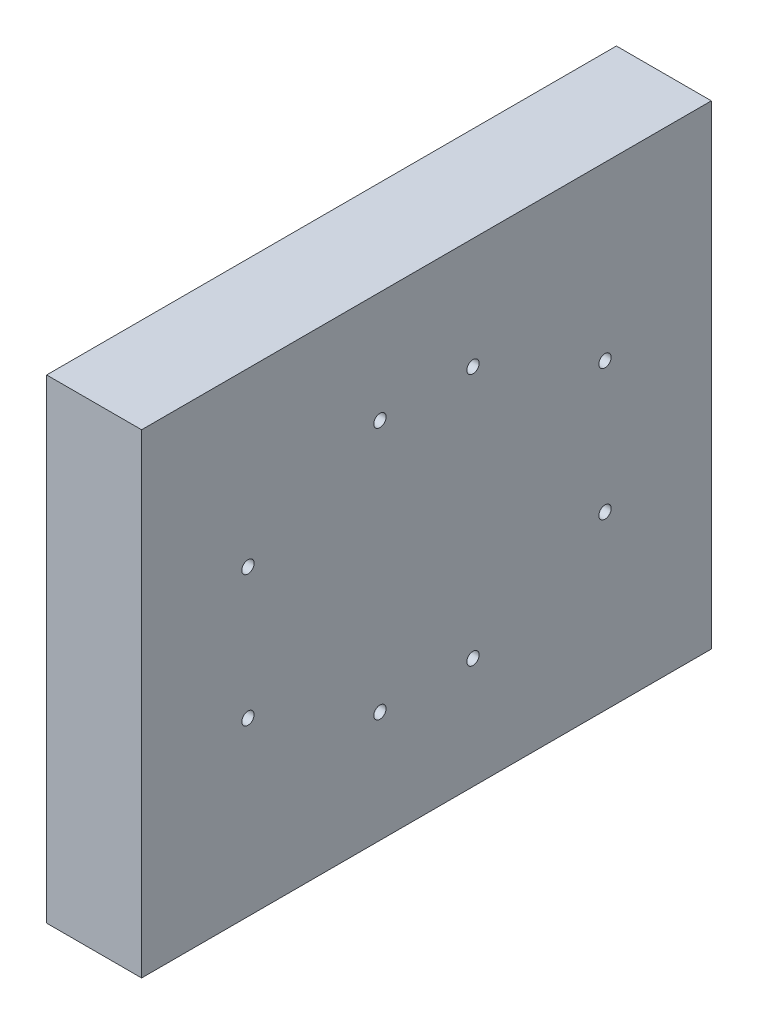
ISO-10303-21;
HEADER;
FILE_DESCRIPTION(('STEP AP214'),'2;1');
FILE_NAME('part.step','',(''),(''),'','','');
FILE_SCHEMA(('AUTOMOTIVE_DESIGN { 1 0 10303 214 1 1 1 1 }'));
ENDSEC;
DATA;
#1=APPLICATION_CONTEXT('core data for automotive mechanical design processes');
#2=APPLICATION_PROTOCOL_DEFINITION('international standard','automotive_design',2000,#1);
#3=PRODUCT_CONTEXT('',#1,'mechanical');
#4=PRODUCT('Part','Part','',(#3));
#5=PRODUCT_RELATED_PRODUCT_CATEGORY('part','',(#4));
#6=PRODUCT_DEFINITION_FORMATION('','',#4);
#7=PRODUCT_DEFINITION_CONTEXT('part definition',#1,'design');
#8=PRODUCT_DEFINITION('design','',#6,#7);
#9=PRODUCT_DEFINITION_SHAPE('','',#8);
#10=(LENGTH_UNIT() NAMED_UNIT(*) SI_UNIT(.MILLI.,.METRE.));
#11=(NAMED_UNIT(*) PLANE_ANGLE_UNIT() SI_UNIT($,.RADIAN.));
#12=(NAMED_UNIT(*) SI_UNIT($,.STERADIAN.) SOLID_ANGLE_UNIT());
#13=UNCERTAINTY_MEASURE_WITH_UNIT(LENGTH_MEASURE(1.E-05),#10,'distance_accuracy_value','');
#14=(GEOMETRIC_REPRESENTATION_CONTEXT(3) GLOBAL_UNCERTAINTY_ASSIGNED_CONTEXT((#13)) GLOBAL_UNIT_ASSIGNED_CONTEXT((#10,
#11,#12)) REPRESENTATION_CONTEXT('',''));
#15=CARTESIAN_POINT('',(0.,0.,0.));
#16=DIRECTION('',(0.,0.,1.));
#17=DIRECTION('',(1.,0.,0.));
#18=AXIS2_PLACEMENT_3D('',#15,#16,#17);
#19=CARTESIAN_POINT('',(25.4,0.,0.));
#20=DIRECTION('',(-1.,0.,0.));
#21=DIRECTION('',(0.,0.,1.));
#22=AXIS2_PLACEMENT_3D('',#19,#20,#21);
#23=PLANE('',#22);
#24=DIRECTION('',(0.,-1.,0.));
#25=VECTOR('',#24,1.);
#26=CARTESIAN_POINT('',(25.4,0.,0.));
#27=LINE('',#26,#25);
#28=CARTESIAN_POINT('',(25.4,127.,0.));
#29=VERTEX_POINT('',#28);
#30=CARTESIAN_POINT('',(25.4,0.,0.));
#31=VERTEX_POINT('',#30);
#32=EDGE_CURVE('E85',#29,#31,#27,.T.);
#33=ORIENTED_EDGE('',*,*,#32,.T.);
#34=DIRECTION('',(0.,0.,-1.));
#35=VECTOR('',#34,1.);
#36=CARTESIAN_POINT('',(25.4,0.,0.));
#37=LINE('',#36,#35);
#38=CARTESIAN_POINT('',(25.4,0.,-152.4));
#39=VERTEX_POINT('',#38);
#40=EDGE_CURVE('E80',#31,#39,#37,.T.);
#41=ORIENTED_EDGE('',*,*,#40,.T.);
#42=DIRECTION('',(0.,1.,0.));
#43=VECTOR('',#42,1.);
#44=CARTESIAN_POINT('',(25.4,0.,-152.4));
#45=LINE('',#44,#43);
#46=CARTESIAN_POINT('',(25.4,127.,-152.4));
#47=VERTEX_POINT('',#46);
#48=EDGE_CURVE('E83',#39,#47,#45,.T.);
#49=ORIENTED_EDGE('',*,*,#48,.T.);
#50=DIRECTION('',(0.,0.,1.));
#51=VECTOR('',#50,1.);
#52=CARTESIAN_POINT('',(25.4,127.,0.));
#53=LINE('',#52,#51);
#54=EDGE_CURVE('E50',#47,#29,#53,.T.);
#55=ORIENTED_EDGE('',*,*,#54,.T.);
#56=EDGE_LOOP('',(#33,#41,#49,#55));
#57=FACE_BOUND('',#56,.T.);
#58=CARTESIAN_POINT('',(25.4,81.026,-28.448));
#59=DIRECTION('',(1.,0.,0.));
#60=DIRECTION('',(0.,0.,-1.));
#61=AXIS2_PLACEMENT_3D('',#58,#59,#60);
#62=CIRCLE('',#61,1.651);
#63=CARTESIAN_POINT('',(25.4,81.026,-30.099));
#64=VERTEX_POINT('',#63);
#65=EDGE_CURVE('E100',#64,#64,#62,.T.);
#66=ORIENTED_EDGE('',*,*,#65,.F.);
#67=EDGE_LOOP('',(#66));
#68=FACE_BOUND('',#67,.T.);
#69=CARTESIAN_POINT('',(25.4,45.974,-28.448));
#70=DIRECTION('',(1.,0.,0.));
#71=DIRECTION('',(0.,0.,-1.));
#72=AXIS2_PLACEMENT_3D('',#69,#70,#71);
#73=CIRCLE('',#72,1.651);
#74=CARTESIAN_POINT('',(25.4,45.974,-30.099));
#75=VERTEX_POINT('',#74);
#76=EDGE_CURVE('E115',#75,#75,#73,.T.);
#77=ORIENTED_EDGE('',*,*,#76,.F.);
#78=EDGE_LOOP('',(#77));
#79=FACE_BOUND('',#78,.T.);
#80=CARTESIAN_POINT('',(25.4,81.026,-123.952));
#81=DIRECTION('',(1.,0.,0.));
#82=DIRECTION('',(0.,0.,-1.));
#83=AXIS2_PLACEMENT_3D('',#80,#81,#82);
#84=CIRCLE('',#83,1.65100000000002);
#85=CARTESIAN_POINT('',(25.4,81.026,-125.603));
#86=VERTEX_POINT('',#85);
#87=EDGE_CURVE('E121',#86,#86,#84,.T.);
#88=ORIENTED_EDGE('',*,*,#87,.F.);
#89=EDGE_LOOP('',(#88));
#90=FACE_BOUND('',#89,.T.);
#91=CARTESIAN_POINT('',(25.4,45.974,-123.952));
#92=DIRECTION('',(1.,0.,0.));
#93=DIRECTION('',(0.,0.,-1.));
#94=AXIS2_PLACEMENT_3D('',#91,#92,#93);
#95=CIRCLE('',#94,1.65100000000002);
#96=CARTESIAN_POINT('',(25.4,45.974,-125.603));
#97=VERTEX_POINT('',#96);
#98=EDGE_CURVE('E127',#97,#97,#95,.T.);
#99=ORIENTED_EDGE('',*,*,#98,.F.);
#100=EDGE_LOOP('',(#99));
#101=FACE_BOUND('',#100,.T.);
#102=CARTESIAN_POINT('',(25.4,97.282,-63.754));
#103=DIRECTION('',(1.,0.,0.));
#104=DIRECTION('',(0.,0.,-1.));
#105=AXIS2_PLACEMENT_3D('',#102,#103,#104);
#106=CIRCLE('',#105,1.65100000000001);
#107=CARTESIAN_POINT('',(25.4,97.282,-65.405));
#108=VERTEX_POINT('',#107);
#109=EDGE_CURVE('E133',#108,#108,#106,.T.);
#110=ORIENTED_EDGE('',*,*,#109,.F.);
#111=EDGE_LOOP('',(#110));
#112=FACE_BOUND('',#111,.T.);
#113=CARTESIAN_POINT('',(25.4,97.282,-88.646));
#114=DIRECTION('',(1.,0.,0.));
#115=DIRECTION('',(0.,0.,-1.));
#116=AXIS2_PLACEMENT_3D('',#113,#114,#115);
#117=CIRCLE('',#116,1.65100000000001);
#118=CARTESIAN_POINT('',(25.4,97.282,-90.297));
#119=VERTEX_POINT('',#118);
#120=EDGE_CURVE('E139',#119,#119,#117,.T.);
#121=ORIENTED_EDGE('',*,*,#120,.F.);
#122=EDGE_LOOP('',(#121));
#123=FACE_BOUND('',#122,.T.);
#124=CARTESIAN_POINT('',(25.4,29.718,-63.754));
#125=DIRECTION('',(1.,0.,0.));
#126=DIRECTION('',(0.,0.,-1.));
#127=AXIS2_PLACEMENT_3D('',#124,#125,#126);
#128=CIRCLE('',#127,1.65100000000001);
#129=CARTESIAN_POINT('',(25.4,29.718,-65.405));
#130=VERTEX_POINT('',#129);
#131=EDGE_CURVE('E145',#130,#130,#128,.T.);
#132=ORIENTED_EDGE('',*,*,#131,.F.);
#133=EDGE_LOOP('',(#132));
#134=FACE_BOUND('',#133,.T.);
#135=CARTESIAN_POINT('',(25.4,29.718,-88.646));
#136=DIRECTION('',(1.,0.,0.));
#137=DIRECTION('',(0.,0.,-1.));
#138=AXIS2_PLACEMENT_3D('',#135,#136,#137);
#139=CIRCLE('',#138,1.65100000000001);
#140=CARTESIAN_POINT('',(25.4,29.718,-90.297));
#141=VERTEX_POINT('',#140);
#142=EDGE_CURVE('E151',#141,#141,#139,.T.);
#143=ORIENTED_EDGE('',*,*,#142,.F.);
#144=EDGE_LOOP('',(#143));
#145=FACE_BOUND('',#144,.T.);
#146=ADVANCED_FACE('F33',(#57,#68,#79,#90,#101,#112,#123,#134,#145),#23,.F.);
#147=CARTESIAN_POINT('',(0.,0.,0.));
#148=DIRECTION('',(-1.,0.,0.));
#149=DIRECTION('',(0.,0.,1.));
#150=AXIS2_PLACEMENT_3D('',#147,#148,#149);
#151=PLANE('',#150);
#152=CARTESIAN_POINT('',(0.,29.718,-63.754));
#153=DIRECTION('',(1.,0.,0.));
#154=DIRECTION('',(0.,0.,-1.));
#155=AXIS2_PLACEMENT_3D('',#152,#153,#154);
#156=CIRCLE('',#155,1.65100000000001);
#157=CARTESIAN_POINT('',(0.,29.718,-65.405));
#158=VERTEX_POINT('',#157);
#159=EDGE_CURVE('E148',#158,#158,#156,.T.);
#160=ORIENTED_EDGE('',*,*,#159,.T.);
#161=EDGE_LOOP('',(#160));
#162=FACE_BOUND('',#161,.T.);
#163=CARTESIAN_POINT('',(0.,97.282,-63.754));
#164=DIRECTION('',(1.,0.,0.));
#165=DIRECTION('',(0.,0.,-1.));
#166=AXIS2_PLACEMENT_3D('',#163,#164,#165);
#167=CIRCLE('',#166,1.65100000000001);
#168=CARTESIAN_POINT('',(0.,97.282,-65.405));
#169=VERTEX_POINT('',#168);
#170=EDGE_CURVE('E136',#169,#169,#167,.T.);
#171=ORIENTED_EDGE('',*,*,#170,.T.);
#172=EDGE_LOOP('',(#171));
#173=FACE_BOUND('',#172,.T.);
#174=CARTESIAN_POINT('',(0.,81.026,-123.952));
#175=DIRECTION('',(1.,0.,0.));
#176=DIRECTION('',(0.,0.,-1.));
#177=AXIS2_PLACEMENT_3D('',#174,#175,#176);
#178=CIRCLE('',#177,1.65100000000002);
#179=CARTESIAN_POINT('',(0.,81.026,-125.603));
#180=VERTEX_POINT('',#179);
#181=EDGE_CURVE('E124',#180,#180,#178,.T.);
#182=ORIENTED_EDGE('',*,*,#181,.T.);
#183=EDGE_LOOP('',(#182));
#184=FACE_BOUND('',#183,.T.);
#185=CARTESIAN_POINT('',(0.,81.026,-28.448));
#186=DIRECTION('',(1.,0.,0.));
#187=DIRECTION('',(0.,0.,-1.));
#188=AXIS2_PLACEMENT_3D('',#185,#186,#187);
#189=CIRCLE('',#188,1.651);
#190=CARTESIAN_POINT('',(0.,81.026,-30.099));
#191=VERTEX_POINT('',#190);
#192=EDGE_CURVE('E112',#191,#191,#189,.T.);
#193=ORIENTED_EDGE('',*,*,#192,.T.);
#194=EDGE_LOOP('',(#193));
#195=FACE_BOUND('',#194,.T.);
#196=DIRECTION('',(0.,-1.,0.));
#197=VECTOR('',#196,1.);
#198=CARTESIAN_POINT('',(0.,0.,0.));
#199=LINE('',#198,#197);
#200=CARTESIAN_POINT('',(0.,127.,0.));
#201=VERTEX_POINT('',#200);
#202=CARTESIAN_POINT('',(0.,0.,0.));
#203=VERTEX_POINT('',#202);
#204=EDGE_CURVE('E97',#201,#203,#199,.T.);
#205=ORIENTED_EDGE('',*,*,#204,.F.);
#206=DIRECTION('',(0.,0.,1.));
#207=VECTOR('',#206,1.);
#208=CARTESIAN_POINT('',(0.,127.,0.));
#209=LINE('',#208,#207);
#210=CARTESIAN_POINT('',(0.,127.,-152.4));
#211=VERTEX_POINT('',#210);
#212=EDGE_CURVE('E73',#211,#201,#209,.T.);
#213=ORIENTED_EDGE('',*,*,#212,.F.);
#214=DIRECTION('',(0.,1.,0.));
#215=VECTOR('',#214,1.);
#216=CARTESIAN_POINT('',(0.,0.,-152.4));
#217=LINE('',#216,#215);
#218=CARTESIAN_POINT('',(0.,0.,-152.4));
#219=VERTEX_POINT('',#218);
#220=EDGE_CURVE('E67',#219,#211,#217,.T.);
#221=ORIENTED_EDGE('',*,*,#220,.F.);
#222=DIRECTION('',(0.,0.,-1.));
#223=VECTOR('',#222,1.);
#224=CARTESIAN_POINT('',(0.,0.,0.));
#225=LINE('',#224,#223);
#226=EDGE_CURVE('E89',#203,#219,#225,.T.);
#227=ORIENTED_EDGE('',*,*,#226,.F.);
#228=EDGE_LOOP('',(#205,#213,#221,#227));
#229=FACE_BOUND('',#228,.T.);
#230=CARTESIAN_POINT('',(0.,45.974,-28.448));
#231=DIRECTION('',(1.,0.,0.));
#232=DIRECTION('',(0.,0.,-1.));
#233=AXIS2_PLACEMENT_3D('',#230,#231,#232);
#234=CIRCLE('',#233,1.651);
#235=CARTESIAN_POINT('',(0.,45.974,-30.099));
#236=VERTEX_POINT('',#235);
#237=EDGE_CURVE('E118',#236,#236,#234,.T.);
#238=ORIENTED_EDGE('',*,*,#237,.T.);
#239=EDGE_LOOP('',(#238));
#240=FACE_BOUND('',#239,.T.);
#241=CARTESIAN_POINT('',(0.,45.974,-123.952));
#242=DIRECTION('',(1.,0.,0.));
#243=DIRECTION('',(0.,0.,-1.));
#244=AXIS2_PLACEMENT_3D('',#241,#242,#243);
#245=CIRCLE('',#244,1.65100000000002);
#246=CARTESIAN_POINT('',(0.,45.974,-125.603));
#247=VERTEX_POINT('',#246);
#248=EDGE_CURVE('E130',#247,#247,#245,.T.);
#249=ORIENTED_EDGE('',*,*,#248,.T.);
#250=EDGE_LOOP('',(#249));
#251=FACE_BOUND('',#250,.T.);
#252=CARTESIAN_POINT('',(0.,97.282,-88.646));
#253=DIRECTION('',(1.,0.,0.));
#254=DIRECTION('',(0.,0.,-1.));
#255=AXIS2_PLACEMENT_3D('',#252,#253,#254);
#256=CIRCLE('',#255,1.65100000000001);
#257=CARTESIAN_POINT('',(0.,97.282,-90.297));
#258=VERTEX_POINT('',#257);
#259=EDGE_CURVE('E142',#258,#258,#256,.T.);
#260=ORIENTED_EDGE('',*,*,#259,.T.);
#261=EDGE_LOOP('',(#260));
#262=FACE_BOUND('',#261,.T.);
#263=CARTESIAN_POINT('',(0.,29.718,-88.646));
#264=DIRECTION('',(1.,0.,0.));
#265=DIRECTION('',(0.,0.,-1.));
#266=AXIS2_PLACEMENT_3D('',#263,#264,#265);
#267=CIRCLE('',#266,1.65100000000001);
#268=CARTESIAN_POINT('',(0.,29.718,-90.297));
#269=VERTEX_POINT('',#268);
#270=EDGE_CURVE('E154',#269,#269,#267,.T.);
#271=ORIENTED_EDGE('',*,*,#270,.T.);
#272=EDGE_LOOP('',(#271));
#273=FACE_BOUND('',#272,.T.);
#274=ADVANCED_FACE('F108',(#162,#173,#184,#195,#229,#240,#251,#262,#273),#151,.T.);
#275=CARTESIAN_POINT('',(25.4,0.,0.));
#276=DIRECTION('',(0.,0.,-1.));
#277=DIRECTION('',(-1.,0.,0.));
#278=AXIS2_PLACEMENT_3D('',#275,#276,#277);
#279=PLANE('',#278);
#280=ORIENTED_EDGE('',*,*,#204,.T.);
#281=DIRECTION('',(-1.,0.,0.));
#282=VECTOR('',#281,1.);
#283=CARTESIAN_POINT('',(25.4,0.,0.));
#284=LINE('',#283,#282);
#285=EDGE_CURVE('E11',#31,#203,#284,.T.);
#286=ORIENTED_EDGE('',*,*,#285,.F.);
#287=ORIENTED_EDGE('',*,*,#32,.F.);
#288=DIRECTION('',(-1.,0.,0.));
#289=VECTOR('',#288,1.);
#290=CARTESIAN_POINT('',(25.4,127.,0.));
#291=LINE('',#290,#289);
#292=EDGE_CURVE('E93',#29,#201,#291,.T.);
#293=ORIENTED_EDGE('',*,*,#292,.T.);
#294=EDGE_LOOP('',(#280,#286,#287,#293));
#295=FACE_BOUND('',#294,.T.);
#296=ADVANCED_FACE('F35',(#295),#279,.F.);
#297=CARTESIAN_POINT('',(25.4,0.,0.));
#298=DIRECTION('',(0.,1.,0.));
#299=DIRECTION('',(0.,0.,1.));
#300=AXIS2_PLACEMENT_3D('',#297,#298,#299);
#301=PLANE('',#300);
#302=ORIENTED_EDGE('',*,*,#226,.T.);
#303=DIRECTION('',(-1.,0.,0.));
#304=VECTOR('',#303,1.);
#305=CARTESIAN_POINT('',(25.4,0.,-152.4));
#306=LINE('',#305,#304);
#307=EDGE_CURVE('E42',#39,#219,#306,.T.);
#308=ORIENTED_EDGE('',*,*,#307,.F.);
#309=ORIENTED_EDGE('',*,*,#40,.F.);
#310=ORIENTED_EDGE('',*,*,#285,.T.);
#311=EDGE_LOOP('',(#302,#308,#309,#310));
#312=FACE_BOUND('',#311,.T.);
#313=ADVANCED_FACE('F88',(#312),#301,.F.);
#314=CARTESIAN_POINT('',(25.4,0.,-152.4));
#315=DIRECTION('',(0.,0.,1.));
#316=DIRECTION('',(1.,0.,0.));
#317=AXIS2_PLACEMENT_3D('',#314,#315,#316);
#318=PLANE('',#317);
#319=ORIENTED_EDGE('',*,*,#220,.T.);
#320=DIRECTION('',(-1.,0.,0.));
#321=VECTOR('',#320,1.);
#322=CARTESIAN_POINT('',(25.4,127.,-152.4));
#323=LINE('',#322,#321);
#324=EDGE_CURVE('E90',#47,#211,#323,.T.);
#325=ORIENTED_EDGE('',*,*,#324,.F.);
#326=ORIENTED_EDGE('',*,*,#48,.F.);
#327=ORIENTED_EDGE('',*,*,#307,.T.);
#328=EDGE_LOOP('',(#319,#325,#326,#327));
#329=FACE_BOUND('',#328,.T.);
#330=ADVANCED_FACE('F91',(#329),#318,.F.);
#331=CARTESIAN_POINT('',(25.4,127.,0.));
#332=DIRECTION('',(0.,-1.,0.));
#333=DIRECTION('',(0.,0.,-1.));
#334=AXIS2_PLACEMENT_3D('',#331,#332,#333);
#335=PLANE('',#334);
#336=ORIENTED_EDGE('',*,*,#212,.T.);
#337=ORIENTED_EDGE('',*,*,#292,.F.);
#338=ORIENTED_EDGE('',*,*,#54,.F.);
#339=ORIENTED_EDGE('',*,*,#324,.T.);
#340=EDGE_LOOP('',(#336,#337,#338,#339));
#341=FACE_BOUND('',#340,.T.);
#342=ADVANCED_FACE('F105',(#341),#335,.F.);
#343=CARTESIAN_POINT('',(25.4,81.026,-28.448));
#344=DIRECTION('',(-1.,0.,0.));
#345=DIRECTION('',(0.,0.,1.));
#346=AXIS2_PLACEMENT_3D('',#343,#344,#345);
#347=CYLINDRICAL_SURFACE('',#346,1.651);
#348=ORIENTED_EDGE('',*,*,#65,.T.);
#349=EDGE_LOOP('',(#348));
#350=FACE_BOUND('',#349,.T.);
#351=ORIENTED_EDGE('',*,*,#192,.F.);
#352=EDGE_LOOP('',(#351));
#353=FACE_BOUND('',#352,.T.);
#354=ADVANCED_FACE('F171',(#350,#353),#347,.F.);
#355=CARTESIAN_POINT('',(25.4,45.974,-28.448));
#356=DIRECTION('',(-1.,0.,0.));
#357=DIRECTION('',(0.,0.,1.));
#358=AXIS2_PLACEMENT_3D('',#355,#356,#357);
#359=CYLINDRICAL_SURFACE('',#358,1.651);
#360=ORIENTED_EDGE('',*,*,#76,.T.);
#361=EDGE_LOOP('',(#360));
#362=FACE_BOUND('',#361,.T.);
#363=ORIENTED_EDGE('',*,*,#237,.F.);
#364=EDGE_LOOP('',(#363));
#365=FACE_BOUND('',#364,.T.);
#366=ADVANCED_FACE('F217',(#362,#365),#359,.F.);
#367=CARTESIAN_POINT('',(25.4,81.026,-123.952));
#368=DIRECTION('',(-1.,0.,0.));
#369=DIRECTION('',(0.,0.,1.));
#370=AXIS2_PLACEMENT_3D('',#367,#368,#369);
#371=CYLINDRICAL_SURFACE('',#370,1.65100000000002);
#372=ORIENTED_EDGE('',*,*,#87,.T.);
#373=EDGE_LOOP('',(#372));
#374=FACE_BOUND('',#373,.T.);
#375=ORIENTED_EDGE('',*,*,#181,.F.);
#376=EDGE_LOOP('',(#375));
#377=FACE_BOUND('',#376,.T.);
#378=ADVANCED_FACE('F225',(#374,#377),#371,.F.);
#379=CARTESIAN_POINT('',(25.4,45.974,-123.952));
#380=DIRECTION('',(-1.,0.,0.));
#381=DIRECTION('',(0.,0.,1.));
#382=AXIS2_PLACEMENT_3D('',#379,#380,#381);
#383=CYLINDRICAL_SURFACE('',#382,1.65100000000002);
#384=ORIENTED_EDGE('',*,*,#98,.T.);
#385=EDGE_LOOP('',(#384));
#386=FACE_BOUND('',#385,.T.);
#387=ORIENTED_EDGE('',*,*,#248,.F.);
#388=EDGE_LOOP('',(#387));
#389=FACE_BOUND('',#388,.T.);
#390=ADVANCED_FACE('F233',(#386,#389),#383,.F.);
#391=CARTESIAN_POINT('',(25.4,97.282,-63.754));
#392=DIRECTION('',(-1.,0.,0.));
#393=DIRECTION('',(0.,0.,1.));
#394=AXIS2_PLACEMENT_3D('',#391,#392,#393);
#395=CYLINDRICAL_SURFACE('',#394,1.65100000000001);
#396=ORIENTED_EDGE('',*,*,#109,.T.);
#397=EDGE_LOOP('',(#396));
#398=FACE_BOUND('',#397,.T.);
#399=ORIENTED_EDGE('',*,*,#170,.F.);
#400=EDGE_LOOP('',(#399));
#401=FACE_BOUND('',#400,.T.);
#402=ADVANCED_FACE('F242',(#398,#401),#395,.F.);
#403=CARTESIAN_POINT('',(25.4,97.282,-88.646));
#404=DIRECTION('',(-1.,0.,0.));
#405=DIRECTION('',(0.,0.,1.));
#406=AXIS2_PLACEMENT_3D('',#403,#404,#405);
#407=CYLINDRICAL_SURFACE('',#406,1.65100000000001);
#408=ORIENTED_EDGE('',*,*,#120,.T.);
#409=EDGE_LOOP('',(#408));
#410=FACE_BOUND('',#409,.T.);
#411=ORIENTED_EDGE('',*,*,#259,.F.);
#412=EDGE_LOOP('',(#411));
#413=FACE_BOUND('',#412,.T.);
#414=ADVANCED_FACE('F251',(#410,#413),#407,.F.);
#415=CARTESIAN_POINT('',(25.4,29.718,-63.754));
#416=DIRECTION('',(-1.,0.,0.));
#417=DIRECTION('',(0.,0.,1.));
#418=AXIS2_PLACEMENT_3D('',#415,#416,#417);
#419=CYLINDRICAL_SURFACE('',#418,1.65100000000001);
#420=ORIENTED_EDGE('',*,*,#131,.T.);
#421=EDGE_LOOP('',(#420));
#422=FACE_BOUND('',#421,.T.);
#423=ORIENTED_EDGE('',*,*,#159,.F.);
#424=EDGE_LOOP('',(#423));
#425=FACE_BOUND('',#424,.T.);
#426=ADVANCED_FACE('F260',(#422,#425),#419,.F.);
#427=CARTESIAN_POINT('',(25.4,29.718,-88.646));
#428=DIRECTION('',(-1.,0.,0.));
#429=DIRECTION('',(0.,0.,1.));
#430=AXIS2_PLACEMENT_3D('',#427,#428,#429);
#431=CYLINDRICAL_SURFACE('',#430,1.65100000000001);
#432=ORIENTED_EDGE('',*,*,#142,.T.);
#433=EDGE_LOOP('',(#432));
#434=FACE_BOUND('',#433,.T.);
#435=ORIENTED_EDGE('',*,*,#270,.F.);
#436=EDGE_LOOP('',(#435));
#437=FACE_BOUND('',#436,.T.);
#438=ADVANCED_FACE('F160',(#434,#437),#431,.F.);
#439=CLOSED_SHELL('',(#146,#274,#296,#313,#330,#342,#354,#366,#378,#390,#402,#414,#426,#438));
#440=MANIFOLD_SOLID_BREP('B2',#439);
#441=ADVANCED_BREP_SHAPE_REPRESENTATION('',(#18,#440),#14);
#442=SHAPE_DEFINITION_REPRESENTATION(#9,#441);
ENDSEC;
END-ISO-10303-21;
